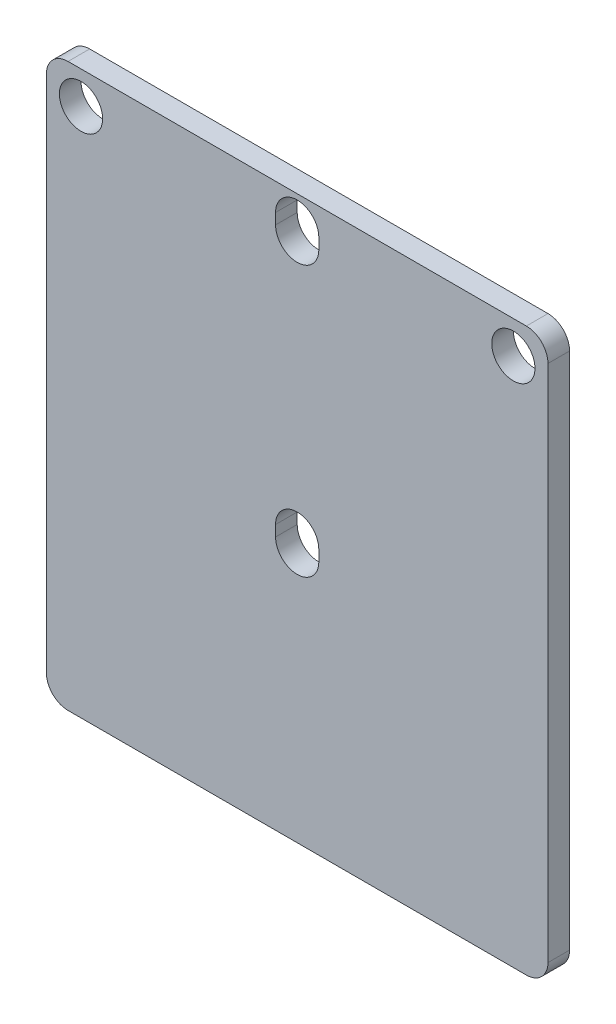
ISO-10303-21;
HEADER;
FILE_DESCRIPTION(('STEP AP214'),'2;1');
FILE_NAME('part.step','',(''),(''),'','','');
FILE_SCHEMA(('AUTOMOTIVE_DESIGN { 1 0 10303 214 1 1 1 1 }'));
ENDSEC;
DATA;
#1=APPLICATION_CONTEXT('core data for automotive mechanical design processes');
#2=APPLICATION_PROTOCOL_DEFINITION('international standard','automotive_design',2000,#1);
#3=PRODUCT_CONTEXT('',#1,'mechanical');
#4=PRODUCT('Part','Part','',(#3));
#5=PRODUCT_RELATED_PRODUCT_CATEGORY('part','',(#4));
#6=PRODUCT_DEFINITION_FORMATION('','',#4);
#7=PRODUCT_DEFINITION_CONTEXT('part definition',#1,'design');
#8=PRODUCT_DEFINITION('design','',#6,#7);
#9=PRODUCT_DEFINITION_SHAPE('','',#8);
#10=(LENGTH_UNIT() NAMED_UNIT(*) SI_UNIT(.MILLI.,.METRE.));
#11=(NAMED_UNIT(*) PLANE_ANGLE_UNIT() SI_UNIT($,.RADIAN.));
#12=(NAMED_UNIT(*) SI_UNIT($,.STERADIAN.) SOLID_ANGLE_UNIT());
#13=UNCERTAINTY_MEASURE_WITH_UNIT(LENGTH_MEASURE(1.E-05),#10,'distance_accuracy_value','');
#14=(GEOMETRIC_REPRESENTATION_CONTEXT(3) GLOBAL_UNCERTAINTY_ASSIGNED_CONTEXT((#13)) GLOBAL_UNIT_ASSIGNED_CONTEXT((#10,
#11,#12)) REPRESENTATION_CONTEXT('',''));
#15=CARTESIAN_POINT('',(0.,0.,0.));
#16=DIRECTION('',(0.,0.,1.));
#17=DIRECTION('',(1.,0.,0.));
#18=AXIS2_PLACEMENT_3D('',#15,#16,#17);
#19=CARTESIAN_POINT('',(-23.2,26.,2.));
#20=DIRECTION('',(1.,0.,0.));
#21=DIRECTION('',(0.,1.,0.));
#22=AXIS2_PLACEMENT_3D('',#19,#20,#21);
#23=PLANE('',#22);
#24=DIRECTION('',(0.,-1.,0.));
#25=VECTOR('',#24,1.);
#26=CARTESIAN_POINT('',(-23.2,26.,0.));
#27=LINE('',#26,#25);
#28=CARTESIAN_POINT('',(-23.2,24.,0.));
#29=VERTEX_POINT('',#28);
#30=CARTESIAN_POINT('',(-23.2,-24.,0.));
#31=VERTEX_POINT('',#30);
#32=EDGE_CURVE('E229',#29,#31,#27,.T.);
#33=ORIENTED_EDGE('',*,*,#32,.T.);
#34=DIRECTION('',(0.,0.,-1.));
#35=VECTOR('',#34,1.);
#36=CARTESIAN_POINT('',(-23.2,-24.,2.));
#37=LINE('',#36,#35);
#38=CARTESIAN_POINT('',(-23.2,-24.,2.));
#39=VERTEX_POINT('',#38);
#40=EDGE_CURVE('E268',#31,#39,#37,.F.);
#41=ORIENTED_EDGE('',*,*,#40,.T.);
#42=DIRECTION('',(0.,-1.,0.));
#43=VECTOR('',#42,1.);
#44=CARTESIAN_POINT('',(-23.2,26.,2.));
#45=LINE('',#44,#43);
#46=CARTESIAN_POINT('',(-23.2,24.,2.));
#47=VERTEX_POINT('',#46);
#48=EDGE_CURVE('E232',#47,#39,#45,.T.);
#49=ORIENTED_EDGE('',*,*,#48,.F.);
#50=DIRECTION('',(0.,0.,-1.));
#51=VECTOR('',#50,1.);
#52=CARTESIAN_POINT('',(-23.2,24.,2.));
#53=LINE('',#52,#51);
#54=EDGE_CURVE('E265',#47,#29,#53,.T.);
#55=ORIENTED_EDGE('',*,*,#54,.T.);
#56=EDGE_LOOP('',(#33,#41,#49,#55));
#57=FACE_BOUND('',#56,.T.);
#58=ADVANCED_FACE('F30',(#57),#23,.F.);
#59=CARTESIAN_POINT('',(-23.2,-26.,2.));
#60=DIRECTION('',(0.,1.,0.));
#61=DIRECTION('',(0.,0.,1.));
#62=AXIS2_PLACEMENT_3D('',#59,#60,#61);
#63=PLANE('',#62);
#64=DIRECTION('',(1.,0.,0.));
#65=VECTOR('',#64,1.);
#66=CARTESIAN_POINT('',(-23.2,-26.,2.));
#67=LINE('',#66,#65);
#68=CARTESIAN_POINT('',(-21.2,-26.,2.));
#69=VERTEX_POINT('',#68);
#70=CARTESIAN_POINT('',(21.2,-26.,2.));
#71=VERTEX_POINT('',#70);
#72=EDGE_CURVE('E235',#69,#71,#67,.T.);
#73=ORIENTED_EDGE('',*,*,#72,.F.);
#74=DIRECTION('',(0.,0.,-1.));
#75=VECTOR('',#74,1.);
#76=CARTESIAN_POINT('',(-21.2,-26.,2.));
#77=LINE('',#76,#75);
#78=CARTESIAN_POINT('',(-21.2,-26.,0.));
#79=VERTEX_POINT('',#78);
#80=EDGE_CURVE('E254',#69,#79,#77,.T.);
#81=ORIENTED_EDGE('',*,*,#80,.T.);
#82=DIRECTION('',(1.,0.,0.));
#83=VECTOR('',#82,1.);
#84=CARTESIAN_POINT('',(-23.2,-26.,0.));
#85=LINE('',#84,#83);
#86=CARTESIAN_POINT('',(21.2,-26.,0.));
#87=VERTEX_POINT('',#86);
#88=EDGE_CURVE('E246',#79,#87,#85,.T.);
#89=ORIENTED_EDGE('',*,*,#88,.T.);
#90=DIRECTION('',(0.,0.,-1.));
#91=VECTOR('',#90,1.);
#92=CARTESIAN_POINT('',(21.2,-26.,2.));
#93=LINE('',#92,#91);
#94=EDGE_CURVE('E243',#87,#71,#93,.F.);
#95=ORIENTED_EDGE('',*,*,#94,.T.);
#96=EDGE_LOOP('',(#73,#81,#89,#95));
#97=FACE_BOUND('',#96,.T.);
#98=ADVANCED_FACE('F310',(#97),#63,.F.);
#99=CARTESIAN_POINT('',(23.2,26.,2.));
#100=DIRECTION('',(-1.,0.,0.));
#101=DIRECTION('',(0.,-1.,0.));
#102=AXIS2_PLACEMENT_3D('',#99,#100,#101);
#103=PLANE('',#102);
#104=DIRECTION('',(0.,1.,0.));
#105=VECTOR('',#104,1.);
#106=CARTESIAN_POINT('',(23.2,26.,2.));
#107=LINE('',#106,#105);
#108=CARTESIAN_POINT('',(23.2,-24.,2.));
#109=VERTEX_POINT('',#108);
#110=CARTESIAN_POINT('',(23.2,24.,2.));
#111=VERTEX_POINT('',#110);
#112=EDGE_CURVE('E239',#109,#111,#107,.T.);
#113=ORIENTED_EDGE('',*,*,#112,.F.);
#114=DIRECTION('',(0.,0.,-1.));
#115=VECTOR('',#114,1.);
#116=CARTESIAN_POINT('',(23.2,-24.,2.));
#117=LINE('',#116,#115);
#118=CARTESIAN_POINT('',(23.2,-24.,0.));
#119=VERTEX_POINT('',#118);
#120=EDGE_CURVE('E279',#109,#119,#117,.T.);
#121=ORIENTED_EDGE('',*,*,#120,.T.);
#122=DIRECTION('',(0.,1.,0.));
#123=VECTOR('',#122,1.);
#124=CARTESIAN_POINT('',(23.2,26.,0.));
#125=LINE('',#124,#123);
#126=CARTESIAN_POINT('',(23.2,24.,0.));
#127=VERTEX_POINT('',#126);
#128=EDGE_CURVE('E249',#119,#127,#125,.T.);
#129=ORIENTED_EDGE('',*,*,#128,.T.);
#130=DIRECTION('',(0.,0.,-1.));
#131=VECTOR('',#130,1.);
#132=CARTESIAN_POINT('',(23.2,24.,2.));
#133=LINE('',#132,#131);
#134=EDGE_CURVE('E277',#127,#111,#133,.F.);
#135=ORIENTED_EDGE('',*,*,#134,.T.);
#136=EDGE_LOOP('',(#113,#121,#129,#135));
#137=FACE_BOUND('',#136,.T.);
#138=ADVANCED_FACE('F285',(#137),#103,.F.);
#139=CARTESIAN_POINT('',(-23.2,26.,2.));
#140=DIRECTION('',(0.,-1.,0.));
#141=DIRECTION('',(0.,0.,-1.));
#142=AXIS2_PLACEMENT_3D('',#139,#140,#141);
#143=PLANE('',#142);
#144=DIRECTION('',(-1.,0.,0.));
#145=VECTOR('',#144,1.);
#146=CARTESIAN_POINT('',(-23.2,26.,2.));
#147=LINE('',#146,#145);
#148=CARTESIAN_POINT('',(21.2,26.,2.));
#149=VERTEX_POINT('',#148);
#150=CARTESIAN_POINT('',(-21.2,26.,2.));
#151=VERTEX_POINT('',#150);
#152=EDGE_CURVE('E241',#149,#151,#147,.T.);
#153=ORIENTED_EDGE('',*,*,#152,.F.);
#154=DIRECTION('',(0.,0.,-1.));
#155=VECTOR('',#154,1.);
#156=CARTESIAN_POINT('',(21.2,26.,2.));
#157=LINE('',#156,#155);
#158=CARTESIAN_POINT('',(21.2,26.,0.));
#159=VERTEX_POINT('',#158);
#160=EDGE_CURVE('E11',#149,#159,#157,.T.);
#161=ORIENTED_EDGE('',*,*,#160,.T.);
#162=DIRECTION('',(-1.,0.,0.));
#163=VECTOR('',#162,1.);
#164=CARTESIAN_POINT('',(-23.2,26.,0.));
#165=LINE('',#164,#163);
#166=CARTESIAN_POINT('',(-21.2,26.,0.));
#167=VERTEX_POINT('',#166);
#168=EDGE_CURVE('E236',#159,#167,#165,.T.);
#169=ORIENTED_EDGE('',*,*,#168,.T.);
#170=DIRECTION('',(0.,0.,-1.));
#171=VECTOR('',#170,1.);
#172=CARTESIAN_POINT('',(-21.2,26.,2.));
#173=LINE('',#172,#171);
#174=EDGE_CURVE('E38',#167,#151,#173,.F.);
#175=ORIENTED_EDGE('',*,*,#174,.T.);
#176=EDGE_LOOP('',(#153,#161,#169,#175));
#177=FACE_BOUND('',#176,.T.);
#178=ADVANCED_FACE('F295',(#177),#143,.F.);
#179=CARTESIAN_POINT('',(-23.2,-26.,2.));
#180=DIRECTION('',(0.,0.,1.));
#181=DIRECTION('',(1.,0.,0.));
#182=AXIS2_PLACEMENT_3D('',#179,#180,#181);
#183=PLANE('',#182);
#184=CARTESIAN_POINT('',(0.,-1.5,2.));
#185=DIRECTION('',(0.,0.,1.));
#186=DIRECTION('',(1.,0.,0.));
#187=AXIS2_PLACEMENT_3D('',#184,#185,#186);
#188=CIRCLE('',#187,2.);
#189=CARTESIAN_POINT('',(2.,-1.49999999999999,2.));
#190=VERTEX_POINT('',#189);
#191=CARTESIAN_POINT('',(-2.,-1.49999999999999,2.));
#192=VERTEX_POINT('',#191);
#193=EDGE_CURVE('E151',#190,#192,#188,.T.);
#194=ORIENTED_EDGE('',*,*,#193,.F.);
#195=DIRECTION('',(0.,1.,0.));
#196=VECTOR('',#195,1.);
#197=CARTESIAN_POINT('',(2.,-1.49999999999999,2.));
#198=LINE('',#197,#196);
#199=CARTESIAN_POINT('',(2.,-2.5,2.));
#200=VERTEX_POINT('',#199);
#201=EDGE_CURVE('E169',#200,#190,#198,.T.);
#202=ORIENTED_EDGE('',*,*,#201,.F.);
#203=CARTESIAN_POINT('',(0.,-2.5,2.));
#204=DIRECTION('',(0.,0.,1.));
#205=DIRECTION('',(1.,0.,0.));
#206=AXIS2_PLACEMENT_3D('',#203,#204,#205);
#207=CIRCLE('',#206,2.);
#208=CARTESIAN_POINT('',(-2.,-2.5,2.));
#209=VERTEX_POINT('',#208);
#210=EDGE_CURVE('E172',#209,#200,#207,.T.);
#211=ORIENTED_EDGE('',*,*,#210,.F.);
#212=DIRECTION('',(0.,-1.,0.));
#213=VECTOR('',#212,1.);
#214=CARTESIAN_POINT('',(-2.,-1.49999999999999,2.));
#215=LINE('',#214,#213);
#216=EDGE_CURVE('E178',#192,#209,#215,.T.);
#217=ORIENTED_EDGE('',*,*,#216,.F.);
#218=EDGE_LOOP('',(#194,#202,#211,#217));
#219=FACE_BOUND('',#218,.T.);
#220=CARTESIAN_POINT('',(0.,23.5,2.));
#221=DIRECTION('',(0.,0.,1.));
#222=DIRECTION('',(1.,0.,0.));
#223=AXIS2_PLACEMENT_3D('',#220,#221,#222);
#224=CIRCLE('',#223,2.);
#225=CARTESIAN_POINT('',(2.,23.5,2.));
#226=VERTEX_POINT('',#225);
#227=CARTESIAN_POINT('',(-2.,23.5,2.));
#228=VERTEX_POINT('',#227);
#229=EDGE_CURVE('E184',#226,#228,#224,.T.);
#230=ORIENTED_EDGE('',*,*,#229,.F.);
#231=DIRECTION('',(0.,1.,0.));
#232=VECTOR('',#231,1.);
#233=CARTESIAN_POINT('',(2.,23.5,2.));
#234=LINE('',#233,#232);
#235=CARTESIAN_POINT('',(2.,22.5,2.));
#236=VERTEX_POINT('',#235);
#237=EDGE_CURVE('E192',#236,#226,#234,.T.);
#238=ORIENTED_EDGE('',*,*,#237,.F.);
#239=CARTESIAN_POINT('',(0.,22.5,2.));
#240=DIRECTION('',(0.,0.,1.));
#241=DIRECTION('',(1.,0.,0.));
#242=AXIS2_PLACEMENT_3D('',#239,#240,#241);
#243=CIRCLE('',#242,2.);
#244=CARTESIAN_POINT('',(-2.,22.5,2.));
#245=VERTEX_POINT('',#244);
#246=EDGE_CURVE('E206',#245,#236,#243,.T.);
#247=ORIENTED_EDGE('',*,*,#246,.F.);
#248=DIRECTION('',(0.,-1.,0.));
#249=VECTOR('',#248,1.);
#250=CARTESIAN_POINT('',(-2.,23.5,2.));
#251=LINE('',#250,#249);
#252=EDGE_CURVE('E203',#228,#245,#251,.T.);
#253=ORIENTED_EDGE('',*,*,#252,.F.);
#254=EDGE_LOOP('',(#230,#238,#247,#253));
#255=FACE_BOUND('',#254,.T.);
#256=CARTESIAN_POINT('',(20.,23.,2.));
#257=DIRECTION('',(0.,0.,1.));
#258=DIRECTION('',(-1.,0.,0.));
#259=AXIS2_PLACEMENT_3D('',#256,#257,#258);
#260=CIRCLE('',#259,2.);
#261=CARTESIAN_POINT('',(18.,23.,2.));
#262=VERTEX_POINT('',#261);
#263=EDGE_CURVE('E213',#262,#262,#260,.T.);
#264=ORIENTED_EDGE('',*,*,#263,.F.);
#265=EDGE_LOOP('',(#264));
#266=FACE_BOUND('',#265,.T.);
#267=CARTESIAN_POINT('',(-20.,23.,2.));
#268=DIRECTION('',(0.,0.,1.));
#269=DIRECTION('',(1.,0.,0.));
#270=AXIS2_PLACEMENT_3D('',#267,#268,#269);
#271=CIRCLE('',#270,2.);
#272=CARTESIAN_POINT('',(-18.,23.,2.));
#273=VERTEX_POINT('',#272);
#274=EDGE_CURVE('E223',#273,#273,#271,.T.);
#275=ORIENTED_EDGE('',*,*,#274,.F.);
#276=EDGE_LOOP('',(#275));
#277=FACE_BOUND('',#276,.T.);
#278=ORIENTED_EDGE('',*,*,#48,.T.);
#279=CARTESIAN_POINT('',(-21.2,-24.,2.));
#280=DIRECTION('',(0.,0.,1.));
#281=DIRECTION('',(1.,0.,0.));
#282=AXIS2_PLACEMENT_3D('',#279,#280,#281);
#283=CIRCLE('',#282,2.);
#284=EDGE_CURVE('E275',#39,#69,#283,.T.);
#285=ORIENTED_EDGE('',*,*,#284,.T.);
#286=ORIENTED_EDGE('',*,*,#72,.T.);
#287=CARTESIAN_POINT('',(21.2,-24.,2.));
#288=DIRECTION('',(0.,0.,1.));
#289=DIRECTION('',(1.,0.,0.));
#290=AXIS2_PLACEMENT_3D('',#287,#288,#289);
#291=CIRCLE('',#290,2.);
#292=EDGE_CURVE('E273',#71,#109,#291,.T.);
#293=ORIENTED_EDGE('',*,*,#292,.T.);
#294=ORIENTED_EDGE('',*,*,#112,.T.);
#295=CARTESIAN_POINT('',(21.2,24.,2.));
#296=DIRECTION('',(0.,0.,1.));
#297=DIRECTION('',(1.,0.,0.));
#298=AXIS2_PLACEMENT_3D('',#295,#296,#297);
#299=CIRCLE('',#298,2.);
#300=EDGE_CURVE('E51',#111,#149,#299,.T.);
#301=ORIENTED_EDGE('',*,*,#300,.T.);
#302=ORIENTED_EDGE('',*,*,#152,.T.);
#303=CARTESIAN_POINT('',(-21.2,24.,2.));
#304=DIRECTION('',(0.,0.,1.));
#305=DIRECTION('',(1.,0.,0.));
#306=AXIS2_PLACEMENT_3D('',#303,#304,#305);
#307=CIRCLE('',#306,2.);
#308=EDGE_CURVE('E270',#151,#47,#307,.T.);
#309=ORIENTED_EDGE('',*,*,#308,.T.);
#310=EDGE_LOOP('',(#278,#285,#286,#293,#294,#301,#302,#309));
#311=FACE_BOUND('',#310,.T.);
#312=ADVANCED_FACE('F297',(#219,#255,#266,#277,#311),#183,.T.);
#313=CARTESIAN_POINT('',(-23.2,-26.,0.));
#314=DIRECTION('',(0.,0.,1.));
#315=DIRECTION('',(1.,0.,0.));
#316=AXIS2_PLACEMENT_3D('',#313,#314,#315);
#317=PLANE('',#316);
#318=DIRECTION('',(0.,1.,0.));
#319=VECTOR('',#318,1.);
#320=CARTESIAN_POINT('',(2.,-1.49999999999999,0.));
#321=LINE('',#320,#319);
#322=CARTESIAN_POINT('',(2.,-2.5,0.));
#323=VERTEX_POINT('',#322);
#324=CARTESIAN_POINT('',(2.,-1.49999999999999,0.));
#325=VERTEX_POINT('',#324);
#326=EDGE_CURVE('E156',#323,#325,#321,.T.);
#327=ORIENTED_EDGE('',*,*,#326,.T.);
#328=CARTESIAN_POINT('',(0.,-1.5,0.));
#329=DIRECTION('',(0.,0.,1.));
#330=DIRECTION('',(1.,0.,0.));
#331=AXIS2_PLACEMENT_3D('',#328,#329,#330);
#332=CIRCLE('',#331,2.);
#333=CARTESIAN_POINT('',(-2.,-1.49999999999999,0.));
#334=VERTEX_POINT('',#333);
#335=EDGE_CURVE('E148',#325,#334,#332,.T.);
#336=ORIENTED_EDGE('',*,*,#335,.T.);
#337=DIRECTION('',(0.,-1.,0.));
#338=VECTOR('',#337,1.);
#339=CARTESIAN_POINT('',(-2.,-1.49999999999999,0.));
#340=LINE('',#339,#338);
#341=CARTESIAN_POINT('',(-2.,-2.5,0.));
#342=VERTEX_POINT('',#341);
#343=EDGE_CURVE('E160',#334,#342,#340,.T.);
#344=ORIENTED_EDGE('',*,*,#343,.T.);
#345=CARTESIAN_POINT('',(0.,-2.5,0.));
#346=DIRECTION('',(0.,0.,1.));
#347=DIRECTION('',(1.,0.,0.));
#348=AXIS2_PLACEMENT_3D('',#345,#346,#347);
#349=CIRCLE('',#348,2.);
#350=EDGE_CURVE('E164',#342,#323,#349,.T.);
#351=ORIENTED_EDGE('',*,*,#350,.T.);
#352=EDGE_LOOP('',(#327,#336,#344,#351));
#353=FACE_BOUND('',#352,.T.);
#354=DIRECTION('',(0.,1.,0.));
#355=VECTOR('',#354,1.);
#356=CARTESIAN_POINT('',(2.,23.5,0.));
#357=LINE('',#356,#355);
#358=CARTESIAN_POINT('',(2.,22.5,0.));
#359=VERTEX_POINT('',#358);
#360=CARTESIAN_POINT('',(2.,23.5,0.));
#361=VERTEX_POINT('',#360);
#362=EDGE_CURVE('E198',#359,#361,#357,.T.);
#363=ORIENTED_EDGE('',*,*,#362,.T.);
#364=CARTESIAN_POINT('',(0.,23.5,0.));
#365=DIRECTION('',(0.,0.,1.));
#366=DIRECTION('',(1.,0.,0.));
#367=AXIS2_PLACEMENT_3D('',#364,#365,#366);
#368=CIRCLE('',#367,2.);
#369=CARTESIAN_POINT('',(-2.,23.5,0.));
#370=VERTEX_POINT('',#369);
#371=EDGE_CURVE('E188',#361,#370,#368,.T.);
#372=ORIENTED_EDGE('',*,*,#371,.T.);
#373=DIRECTION('',(0.,-1.,0.));
#374=VECTOR('',#373,1.);
#375=CARTESIAN_POINT('',(-2.,23.5,0.));
#376=LINE('',#375,#374);
#377=CARTESIAN_POINT('',(-2.,22.5,0.));
#378=VERTEX_POINT('',#377);
#379=EDGE_CURVE('E191',#370,#378,#376,.T.);
#380=ORIENTED_EDGE('',*,*,#379,.T.);
#381=CARTESIAN_POINT('',(0.,22.5,0.));
#382=DIRECTION('',(0.,0.,1.));
#383=DIRECTION('',(1.,0.,0.));
#384=AXIS2_PLACEMENT_3D('',#381,#382,#383);
#385=CIRCLE('',#384,2.);
#386=EDGE_CURVE('E195',#378,#359,#385,.T.);
#387=ORIENTED_EDGE('',*,*,#386,.T.);
#388=EDGE_LOOP('',(#363,#372,#380,#387));
#389=FACE_BOUND('',#388,.T.);
#390=CARTESIAN_POINT('',(20.,23.,0.));
#391=DIRECTION('',(0.,0.,1.));
#392=DIRECTION('',(-1.,0.,0.));
#393=AXIS2_PLACEMENT_3D('',#390,#391,#392);
#394=CIRCLE('',#393,2.);
#395=CARTESIAN_POINT('',(18.,23.,0.));
#396=VERTEX_POINT('',#395);
#397=EDGE_CURVE('E220',#396,#396,#394,.T.);
#398=ORIENTED_EDGE('',*,*,#397,.T.);
#399=EDGE_LOOP('',(#398));
#400=FACE_BOUND('',#399,.T.);
#401=CARTESIAN_POINT('',(-20.,23.,0.));
#402=DIRECTION('',(0.,0.,1.));
#403=DIRECTION('',(1.,0.,0.));
#404=AXIS2_PLACEMENT_3D('',#401,#402,#403);
#405=CIRCLE('',#404,2.);
#406=CARTESIAN_POINT('',(-18.,23.,0.));
#407=VERTEX_POINT('',#406);
#408=EDGE_CURVE('E226',#407,#407,#405,.T.);
#409=ORIENTED_EDGE('',*,*,#408,.T.);
#410=EDGE_LOOP('',(#409));
#411=FACE_BOUND('',#410,.T.);
#412=ORIENTED_EDGE('',*,*,#88,.F.);
#413=CARTESIAN_POINT('',(-21.2,-24.,0.));
#414=DIRECTION('',(0.,0.,1.));
#415=DIRECTION('',(1.,0.,0.));
#416=AXIS2_PLACEMENT_3D('',#413,#414,#415);
#417=CIRCLE('',#416,2.);
#418=EDGE_CURVE('E263',#79,#31,#417,.F.);
#419=ORIENTED_EDGE('',*,*,#418,.T.);
#420=ORIENTED_EDGE('',*,*,#32,.F.);
#421=CARTESIAN_POINT('',(-21.2,24.,0.));
#422=DIRECTION('',(0.,0.,1.));
#423=DIRECTION('',(1.,0.,0.));
#424=AXIS2_PLACEMENT_3D('',#421,#422,#423);
#425=CIRCLE('',#424,2.);
#426=EDGE_CURVE('E257',#29,#167,#425,.F.);
#427=ORIENTED_EDGE('',*,*,#426,.T.);
#428=ORIENTED_EDGE('',*,*,#168,.F.);
#429=CARTESIAN_POINT('',(21.2,24.,0.));
#430=DIRECTION('',(0.,0.,1.));
#431=DIRECTION('',(1.,0.,0.));
#432=AXIS2_PLACEMENT_3D('',#429,#430,#431);
#433=CIRCLE('',#432,2.);
#434=EDGE_CURVE('E259',#159,#127,#433,.F.);
#435=ORIENTED_EDGE('',*,*,#434,.T.);
#436=ORIENTED_EDGE('',*,*,#128,.F.);
#437=CARTESIAN_POINT('',(21.2,-24.,0.));
#438=DIRECTION('',(0.,0.,1.));
#439=DIRECTION('',(1.,0.,0.));
#440=AXIS2_PLACEMENT_3D('',#437,#438,#439);
#441=CIRCLE('',#440,2.);
#442=EDGE_CURVE('E261',#119,#87,#441,.F.);
#443=ORIENTED_EDGE('',*,*,#442,.T.);
#444=EDGE_LOOP('',(#412,#419,#420,#427,#428,#435,#436,#443));
#445=FACE_BOUND('',#444,.T.);
#446=ADVANCED_FACE('F166',(#353,#389,#400,#411,#445),#317,.F.);
#447=CARTESIAN_POINT('',(-20.,23.,0.));
#448=DIRECTION('',(0.,0.,1.));
#449=DIRECTION('',(1.,0.,0.));
#450=AXIS2_PLACEMENT_3D('',#447,#448,#449);
#451=CYLINDRICAL_SURFACE('',#450,2.);
#452=ORIENTED_EDGE('',*,*,#408,.F.);
#453=EDGE_LOOP('',(#452));
#454=FACE_BOUND('',#453,.T.);
#455=ORIENTED_EDGE('',*,*,#274,.T.);
#456=EDGE_LOOP('',(#455));
#457=FACE_BOUND('',#456,.T.);
#458=ADVANCED_FACE('F333',(#454,#457),#451,.F.);
#459=CARTESIAN_POINT('',(20.,23.,0.));
#460=DIRECTION('',(0.,0.,1.));
#461=DIRECTION('',(1.,0.,0.));
#462=AXIS2_PLACEMENT_3D('',#459,#460,#461);
#463=CYLINDRICAL_SURFACE('',#462,2.);
#464=ORIENTED_EDGE('',*,*,#397,.F.);
#465=EDGE_LOOP('',(#464));
#466=FACE_BOUND('',#465,.T.);
#467=ORIENTED_EDGE('',*,*,#263,.T.);
#468=EDGE_LOOP('',(#467));
#469=FACE_BOUND('',#468,.T.);
#470=ADVANCED_FACE('F339',(#466,#469),#463,.F.);
#471=CARTESIAN_POINT('',(0.,23.5,0.));
#472=DIRECTION('',(0.,0.,1.));
#473=DIRECTION('',(1.,0.,0.));
#474=AXIS2_PLACEMENT_3D('',#471,#472,#473);
#475=CYLINDRICAL_SURFACE('',#474,2.);
#476=ORIENTED_EDGE('',*,*,#229,.T.);
#477=DIRECTION('',(0.,0.,1.));
#478=VECTOR('',#477,1.);
#479=CARTESIAN_POINT('',(-2.,23.5,0.));
#480=LINE('',#479,#478);
#481=EDGE_CURVE('E201',#370,#228,#480,.T.);
#482=ORIENTED_EDGE('',*,*,#481,.F.);
#483=ORIENTED_EDGE('',*,*,#371,.F.);
#484=DIRECTION('',(0.,0.,1.));
#485=VECTOR('',#484,1.);
#486=CARTESIAN_POINT('',(2.,23.5,0.));
#487=LINE('',#486,#485);
#488=EDGE_CURVE('E211',#361,#226,#487,.T.);
#489=ORIENTED_EDGE('',*,*,#488,.T.);
#490=EDGE_LOOP('',(#476,#482,#483,#489));
#491=FACE_BOUND('',#490,.T.);
#492=ADVANCED_FACE('F343',(#491),#475,.F.);
#493=CARTESIAN_POINT('',(2.,23.5,0.));
#494=DIRECTION('',(1.,0.,0.));
#495=DIRECTION('',(0.,0.,-1.));
#496=AXIS2_PLACEMENT_3D('',#493,#494,#495);
#497=PLANE('',#496);
#498=ORIENTED_EDGE('',*,*,#237,.T.);
#499=ORIENTED_EDGE('',*,*,#488,.F.);
#500=ORIENTED_EDGE('',*,*,#362,.F.);
#501=DIRECTION('',(0.,0.,1.));
#502=VECTOR('',#501,1.);
#503=CARTESIAN_POINT('',(2.,22.5,0.));
#504=LINE('',#503,#502);
#505=EDGE_CURVE('E214',#359,#236,#504,.T.);
#506=ORIENTED_EDGE('',*,*,#505,.T.);
#507=EDGE_LOOP('',(#498,#499,#500,#506));
#508=FACE_BOUND('',#507,.T.);
#509=ADVANCED_FACE('F347',(#508),#497,.F.);
#510=CARTESIAN_POINT('',(0.,22.5,0.));
#511=DIRECTION('',(0.,0.,1.));
#512=DIRECTION('',(1.,0.,0.));
#513=AXIS2_PLACEMENT_3D('',#510,#511,#512);
#514=CYLINDRICAL_SURFACE('',#513,2.);
#515=ORIENTED_EDGE('',*,*,#246,.T.);
#516=ORIENTED_EDGE('',*,*,#505,.F.);
#517=ORIENTED_EDGE('',*,*,#386,.F.);
#518=DIRECTION('',(0.,0.,1.));
#519=VECTOR('',#518,1.);
#520=CARTESIAN_POINT('',(-2.,22.5,0.));
#521=LINE('',#520,#519);
#522=EDGE_CURVE('E216',#378,#245,#521,.T.);
#523=ORIENTED_EDGE('',*,*,#522,.T.);
#524=EDGE_LOOP('',(#515,#516,#517,#523));
#525=FACE_BOUND('',#524,.T.);
#526=ADVANCED_FACE('F352',(#525),#514,.F.);
#527=CARTESIAN_POINT('',(-2.,23.5,0.));
#528=DIRECTION('',(-1.,0.,0.));
#529=DIRECTION('',(0.,0.,1.));
#530=AXIS2_PLACEMENT_3D('',#527,#528,#529);
#531=PLANE('',#530);
#532=ORIENTED_EDGE('',*,*,#252,.T.);
#533=ORIENTED_EDGE('',*,*,#522,.F.);
#534=ORIENTED_EDGE('',*,*,#379,.F.);
#535=ORIENTED_EDGE('',*,*,#481,.T.);
#536=EDGE_LOOP('',(#532,#533,#534,#535));
#537=FACE_BOUND('',#536,.T.);
#538=ADVANCED_FACE('F349',(#537),#531,.F.);
#539=CARTESIAN_POINT('',(0.,-1.5,0.));
#540=DIRECTION('',(0.,0.,1.));
#541=DIRECTION('',(1.,0.,0.));
#542=AXIS2_PLACEMENT_3D('',#539,#540,#541);
#543=CYLINDRICAL_SURFACE('',#542,2.);
#544=ORIENTED_EDGE('',*,*,#193,.T.);
#545=DIRECTION('',(0.,0.,1.));
#546=VECTOR('',#545,1.);
#547=CARTESIAN_POINT('',(-2.,-1.49999999999999,0.));
#548=LINE('',#547,#546);
#549=EDGE_CURVE('E144',#334,#192,#548,.T.);
#550=ORIENTED_EDGE('',*,*,#549,.F.);
#551=ORIENTED_EDGE('',*,*,#335,.F.);
#552=DIRECTION('',(0.,0.,1.));
#553=VECTOR('',#552,1.);
#554=CARTESIAN_POINT('',(2.,-1.49999999999999,0.));
#555=LINE('',#554,#553);
#556=EDGE_CURVE('E182',#325,#190,#555,.T.);
#557=ORIENTED_EDGE('',*,*,#556,.T.);
#558=EDGE_LOOP('',(#544,#550,#551,#557));
#559=FACE_BOUND('',#558,.T.);
#560=ADVANCED_FACE('F146',(#559),#543,.F.);
#561=CARTESIAN_POINT('',(2.,-1.49999999999999,0.));
#562=DIRECTION('',(1.,0.,0.));
#563=DIRECTION('',(0.,0.,-1.));
#564=AXIS2_PLACEMENT_3D('',#561,#562,#563);
#565=PLANE('',#564);
#566=ORIENTED_EDGE('',*,*,#201,.T.);
#567=ORIENTED_EDGE('',*,*,#556,.F.);
#568=ORIENTED_EDGE('',*,*,#326,.F.);
#569=DIRECTION('',(0.,0.,1.));
#570=VECTOR('',#569,1.);
#571=CARTESIAN_POINT('',(2.,-2.5,0.));
#572=LINE('',#571,#570);
#573=EDGE_CURVE('E185',#323,#200,#572,.T.);
#574=ORIENTED_EDGE('',*,*,#573,.T.);
#575=EDGE_LOOP('',(#566,#567,#568,#574));
#576=FACE_BOUND('',#575,.T.);
#577=ADVANCED_FACE('F362',(#576),#565,.F.);
#578=CARTESIAN_POINT('',(0.,-2.5,0.));
#579=DIRECTION('',(0.,0.,1.));
#580=DIRECTION('',(1.,0.,0.));
#581=AXIS2_PLACEMENT_3D('',#578,#579,#580);
#582=CYLINDRICAL_SURFACE('',#581,2.);
#583=ORIENTED_EDGE('',*,*,#210,.T.);
#584=ORIENTED_EDGE('',*,*,#573,.F.);
#585=ORIENTED_EDGE('',*,*,#350,.F.);
#586=DIRECTION('',(0.,0.,1.));
#587=VECTOR('',#586,1.);
#588=CARTESIAN_POINT('',(-2.,-2.5,0.));
#589=LINE('',#588,#587);
#590=EDGE_CURVE('E155',#342,#209,#589,.T.);
#591=ORIENTED_EDGE('',*,*,#590,.T.);
#592=EDGE_LOOP('',(#583,#584,#585,#591));
#593=FACE_BOUND('',#592,.T.);
#594=ADVANCED_FACE('F365',(#593),#582,.F.);
#595=CARTESIAN_POINT('',(-2.,-1.49999999999999,0.));
#596=DIRECTION('',(-1.,0.,0.));
#597=DIRECTION('',(0.,0.,1.));
#598=AXIS2_PLACEMENT_3D('',#595,#596,#597);
#599=PLANE('',#598);
#600=ORIENTED_EDGE('',*,*,#216,.T.);
#601=ORIENTED_EDGE('',*,*,#590,.F.);
#602=ORIENTED_EDGE('',*,*,#343,.F.);
#603=ORIENTED_EDGE('',*,*,#549,.T.);
#604=EDGE_LOOP('',(#600,#601,#602,#603));
#605=FACE_BOUND('',#604,.T.);
#606=ADVANCED_FACE('F161',(#605),#599,.F.);
#607=CARTESIAN_POINT('',(-21.2,-24.,2.));
#608=DIRECTION('',(0.,0.,-1.));
#609=DIRECTION('',(-1.,0.,0.));
#610=AXIS2_PLACEMENT_3D('',#607,#608,#609);
#611=CYLINDRICAL_SURFACE('',#610,2.);
#612=ORIENTED_EDGE('',*,*,#284,.F.);
#613=ORIENTED_EDGE('',*,*,#40,.F.);
#614=ORIENTED_EDGE('',*,*,#418,.F.);
#615=ORIENTED_EDGE('',*,*,#80,.F.);
#616=EDGE_LOOP('',(#612,#613,#614,#615));
#617=FACE_BOUND('',#616,.T.);
#618=ADVANCED_FACE('F307',(#617),#611,.T.);
#619=CARTESIAN_POINT('',(21.2,-24.,2.));
#620=DIRECTION('',(0.,0.,-1.));
#621=DIRECTION('',(-1.,0.,0.));
#622=AXIS2_PLACEMENT_3D('',#619,#620,#621);
#623=CYLINDRICAL_SURFACE('',#622,2.);
#624=ORIENTED_EDGE('',*,*,#292,.F.);
#625=ORIENTED_EDGE('',*,*,#94,.F.);
#626=ORIENTED_EDGE('',*,*,#442,.F.);
#627=ORIENTED_EDGE('',*,*,#120,.F.);
#628=EDGE_LOOP('',(#624,#625,#626,#627));
#629=FACE_BOUND('',#628,.T.);
#630=ADVANCED_FACE('F312',(#629),#623,.T.);
#631=CARTESIAN_POINT('',(21.2,24.,2.));
#632=DIRECTION('',(0.,0.,-1.));
#633=DIRECTION('',(-1.,0.,0.));
#634=AXIS2_PLACEMENT_3D('',#631,#632,#633);
#635=CYLINDRICAL_SURFACE('',#634,2.);
#636=ORIENTED_EDGE('',*,*,#300,.F.);
#637=ORIENTED_EDGE('',*,*,#134,.F.);
#638=ORIENTED_EDGE('',*,*,#434,.F.);
#639=ORIENTED_EDGE('',*,*,#160,.F.);
#640=EDGE_LOOP('',(#636,#637,#638,#639));
#641=FACE_BOUND('',#640,.T.);
#642=ADVANCED_FACE('F294',(#641),#635,.T.);
#643=CARTESIAN_POINT('',(-21.2,24.,2.));
#644=DIRECTION('',(0.,0.,-1.));
#645=DIRECTION('',(-1.,0.,0.));
#646=AXIS2_PLACEMENT_3D('',#643,#644,#645);
#647=CYLINDRICAL_SURFACE('',#646,2.);
#648=ORIENTED_EDGE('',*,*,#308,.F.);
#649=ORIENTED_EDGE('',*,*,#174,.F.);
#650=ORIENTED_EDGE('',*,*,#426,.F.);
#651=ORIENTED_EDGE('',*,*,#54,.F.);
#652=EDGE_LOOP('',(#648,#649,#650,#651));
#653=FACE_BOUND('',#652,.T.);
#654=ADVANCED_FACE('F32',(#653),#647,.T.);
#655=CLOSED_SHELL('',(#58,#98,#138,#178,#312,#446,#458,#470,#492,#509,#526,#538,#560,#577,#594,
#606,#618,#630,#642,#654));
#656=MANIFOLD_SOLID_BREP('B2',#655);
#657=ADVANCED_BREP_SHAPE_REPRESENTATION('',(#18,#656),#14);
#658=SHAPE_DEFINITION_REPRESENTATION(#9,#657);
ENDSEC;
END-ISO-10303-21;
